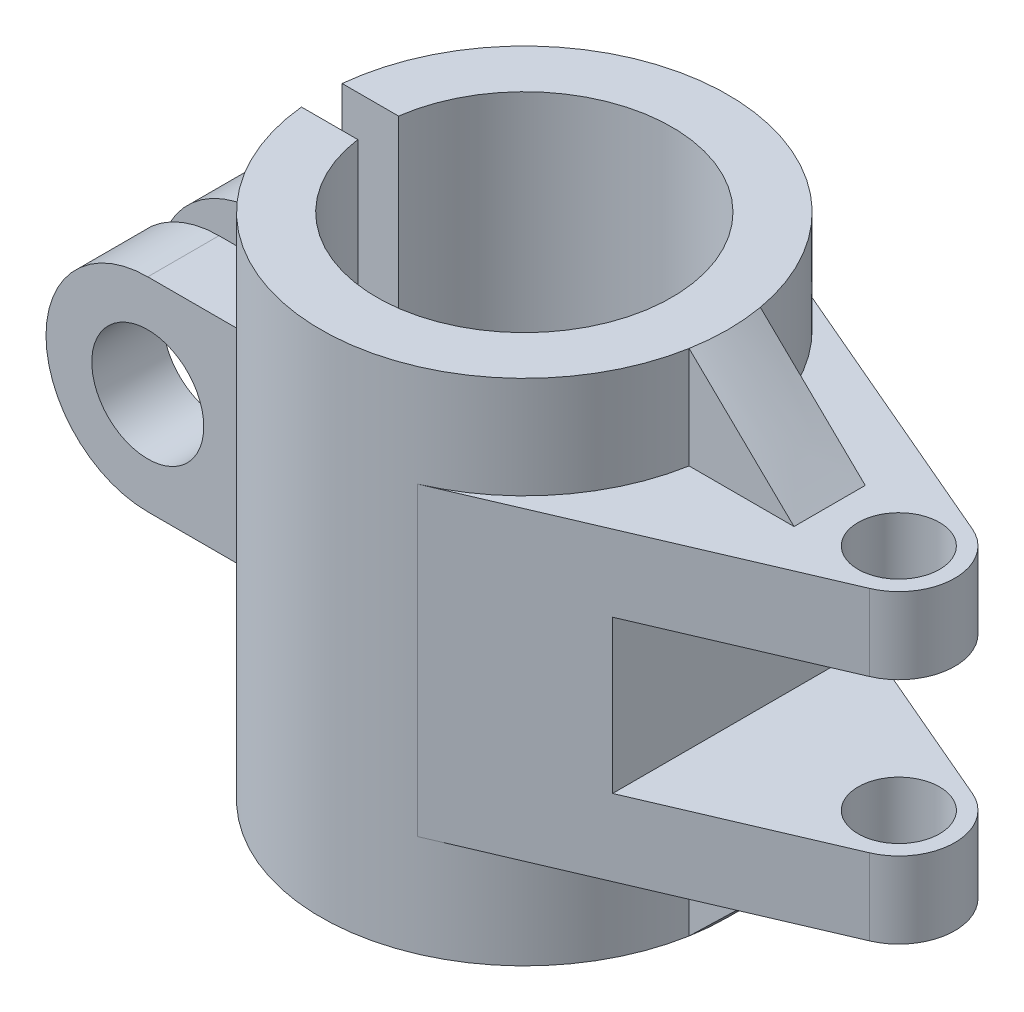
ISO-10303-21;
HEADER;
FILE_DESCRIPTION(('STEP AP214'),'2;1');
FILE_NAME('part.step','',(''),(''),'','','');
FILE_SCHEMA(('AUTOMOTIVE_DESIGN { 1 0 10303 214 1 1 1 1 }'));
ENDSEC;
DATA;
#1=APPLICATION_CONTEXT('core data for automotive mechanical design processes');
#2=APPLICATION_PROTOCOL_DEFINITION('international standard','automotive_design',2000,#1);
#3=PRODUCT_CONTEXT('',#1,'mechanical');
#4=PRODUCT('Part','Part','',(#3));
#5=PRODUCT_RELATED_PRODUCT_CATEGORY('part','',(#4));
#6=PRODUCT_DEFINITION_FORMATION('','',#4);
#7=PRODUCT_DEFINITION_CONTEXT('part definition',#1,'design');
#8=PRODUCT_DEFINITION('design','',#6,#7);
#9=PRODUCT_DEFINITION_SHAPE('','',#8);
#10=(LENGTH_UNIT() NAMED_UNIT(*) SI_UNIT(.MILLI.,.METRE.));
#11=(NAMED_UNIT(*) PLANE_ANGLE_UNIT() SI_UNIT($,.RADIAN.));
#12=(NAMED_UNIT(*) SI_UNIT($,.STERADIAN.) SOLID_ANGLE_UNIT());
#13=UNCERTAINTY_MEASURE_WITH_UNIT(LENGTH_MEASURE(1.E-05),#10,'distance_accuracy_value','');
#14=(GEOMETRIC_REPRESENTATION_CONTEXT(3) GLOBAL_UNCERTAINTY_ASSIGNED_CONTEXT((#13)) GLOBAL_UNIT_ASSIGNED_CONTEXT((#10,
#11,#12)) REPRESENTATION_CONTEXT('',''));
#15=CARTESIAN_POINT('',(0.,0.,0.));
#16=DIRECTION('',(0.,0.,1.));
#17=DIRECTION('',(1.,0.,0.));
#18=AXIS2_PLACEMENT_3D('',#15,#16,#17);
#19=CARTESIAN_POINT('',(0.,25.,0.));
#20=DIRECTION('',(0.,-1.,0.));
#21=DIRECTION('',(0.,0.,-1.));
#22=AXIS2_PLACEMENT_3D('',#19,#20,#21);
#23=CYLINDRICAL_SURFACE('',#22,20.);
#24=DIRECTION('',(0.,-1.,0.));
#25=VECTOR('',#24,1.);
#26=CARTESIAN_POINT('',(19.6913686675152,-20.,-3.5));
#27=LINE('',#26,#25);
#28=CARTESIAN_POINT('',(19.6913686675153,-15.,-3.49999999999957));
#29=VERTEX_POINT('',#28);
#30=CARTESIAN_POINT('',(19.6913686675152,-25.,-3.5));
#31=VERTEX_POINT('',#30);
#32=EDGE_CURVE('E551',#29,#31,#27,.T.);
#33=ORIENTED_EDGE('',*,*,#32,.T.);
#34=CARTESIAN_POINT('',(0.,-25.,0.));
#35=DIRECTION('',(0.,1.,0.));
#36=DIRECTION('',(0.,0.,1.));
#37=AXIS2_PLACEMENT_3D('',#34,#35,#36);
#38=CIRCLE('',#37,20.);
#39=CARTESIAN_POINT('',(-19.8997487421324,-25.,-2.));
#40=VERTEX_POINT('',#39);
#41=EDGE_CURVE('E1000',#31,#40,#38,.T.);
#42=ORIENTED_EDGE('',*,*,#41,.T.);
#43=DIRECTION('',(0.,-1.,0.));
#44=VECTOR('',#43,1.);
#45=CARTESIAN_POINT('',(-19.8997487421324,25.,-2.));
#46=LINE('',#45,#44);
#47=CARTESIAN_POINT('',(-19.8997487421324,-10.,-2.));
#48=VERTEX_POINT('',#47);
#49=EDGE_CURVE('E986',#48,#40,#46,.T.);
#50=ORIENTED_EDGE('',*,*,#49,.F.);
#51=CARTESIAN_POINT('',(0.,-10.,0.));
#52=DIRECTION('',(0.,-1.,0.));
#53=DIRECTION('',(0.,0.,-1.));
#54=AXIS2_PLACEMENT_3D('',#51,#52,#53);
#55=CIRCLE('',#54,20.);
#56=CARTESIAN_POINT('',(-17.8605710994918,-10.,-9.));
#57=VERTEX_POINT('',#56);
#58=EDGE_CURVE('E894',#48,#57,#55,.T.);
#59=ORIENTED_EDGE('',*,*,#58,.T.);
#60=DIRECTION('',(0.,-1.,0.));
#61=VECTOR('',#60,1.);
#62=CARTESIAN_POINT('',(-17.8605710994918,10.,-9.));
#63=LINE('',#62,#61);
#64=CARTESIAN_POINT('',(-17.8605710994918,10.,-9.));
#65=VERTEX_POINT('',#64);
#66=EDGE_CURVE('E905',#65,#57,#63,.T.);
#67=ORIENTED_EDGE('',*,*,#66,.F.);
#68=CARTESIAN_POINT('',(0.,10.,0.));
#69=DIRECTION('',(0.,-1.,0.));
#70=DIRECTION('',(0.,0.,-1.));
#71=AXIS2_PLACEMENT_3D('',#68,#69,#70);
#72=CIRCLE('',#71,20.);
#73=CARTESIAN_POINT('',(-19.8997487421324,10.,-2.));
#74=VERTEX_POINT('',#73);
#75=EDGE_CURVE('E911',#74,#65,#72,.T.);
#76=ORIENTED_EDGE('',*,*,#75,.F.);
#77=CARTESIAN_POINT('',(-19.8997487421324,25.,-2.));
#78=VERTEX_POINT('',#77);
#79=EDGE_CURVE('E984',#78,#74,#46,.T.);
#80=ORIENTED_EDGE('',*,*,#79,.F.);
#81=CARTESIAN_POINT('',(0.,25.,0.));
#82=DIRECTION('',(0.,1.,0.));
#83=DIRECTION('',(0.,0.,1.));
#84=AXIS2_PLACEMENT_3D('',#81,#82,#83);
#85=CIRCLE('',#84,20.);
#86=CARTESIAN_POINT('',(19.6913686675152,25.,-3.5));
#87=VERTEX_POINT('',#86);
#88=EDGE_CURVE('E1072',#87,#78,#85,.T.);
#89=ORIENTED_EDGE('',*,*,#88,.F.);
#90=DIRECTION('',(0.,1.,0.));
#91=VECTOR('',#90,1.);
#92=CARTESIAN_POINT('',(19.6913686675152,20.,-3.5));
#93=LINE('',#92,#91);
#94=CARTESIAN_POINT('',(19.6913686675152,15.,-3.49999999999999));
#95=VERTEX_POINT('',#94);
#96=EDGE_CURVE('E1108',#95,#87,#93,.T.);
#97=ORIENTED_EDGE('',*,*,#96,.F.);
#98=CARTESIAN_POINT('',(0.,15.,0.));
#99=DIRECTION('',(0.,1.,0.));
#100=DIRECTION('',(0.,0.,1.));
#101=AXIS2_PLACEMENT_3D('',#98,#99,#100);
#102=CIRCLE('',#101,20.);
#103=CARTESIAN_POINT('',(7.8804347826087,15.,-18.3820224033443));
#104=VERTEX_POINT('',#103);
#105=EDGE_CURVE('E967',#95,#104,#102,.T.);
#106=ORIENTED_EDGE('',*,*,#105,.T.);
#107=DIRECTION('',(0.,-1.,0.));
#108=VECTOR('',#107,1.);
#109=CARTESIAN_POINT('',(7.8804347826087,15.,-18.3820224033443));
#110=LINE('',#109,#108);
#111=CARTESIAN_POINT('',(7.8804347826087,-15.,-18.3820224033443));
#112=VERTEX_POINT('',#111);
#113=EDGE_CURVE('E1207',#104,#112,#110,.T.);
#114=ORIENTED_EDGE('',*,*,#113,.T.);
#115=CARTESIAN_POINT('',(0.,-15.,0.));
#116=DIRECTION('',(0.,1.,0.));
#117=DIRECTION('',(0.,0.,1.));
#118=AXIS2_PLACEMENT_3D('',#115,#116,#117);
#119=CIRCLE('',#118,20.);
#120=EDGE_CURVE('E1065',#29,#112,#119,.T.);
#121=ORIENTED_EDGE('',*,*,#120,.F.);
#122=EDGE_LOOP('',(#33,#42,#50,#59,#67,#76,#80,#89,#97,#106,#114,#121));
#123=FACE_BOUND('',#122,.T.);
#124=ADVANCED_FACE('F533',(#123),#23,.T.);
#125=CARTESIAN_POINT('',(-28.,0.,-11.));
#126=DIRECTION('',(0.,0.,1.));
#127=DIRECTION('',(1.,0.,0.));
#128=AXIS2_PLACEMENT_3D('',#125,#126,#127);
#129=CYLINDRICAL_SURFACE('',#128,10.);
#130=CARTESIAN_POINT('',(-28.,0.,2.));
#131=DIRECTION('',(0.,0.,-1.));
#132=DIRECTION('',(-1.,0.,0.));
#133=AXIS2_PLACEMENT_3D('',#130,#131,#132);
#134=CIRCLE('',#133,10.);
#135=CARTESIAN_POINT('',(-28.,-10.,2.));
#136=VERTEX_POINT('',#135);
#137=CARTESIAN_POINT('',(-28.,10.,2.));
#138=VERTEX_POINT('',#137);
#139=EDGE_CURVE('E1191',#136,#138,#134,.T.);
#140=ORIENTED_EDGE('',*,*,#139,.F.);
#141=DIRECTION('',(0.,0.,1.));
#142=VECTOR('',#141,1.);
#143=CARTESIAN_POINT('',(-28.,-10.,-11.));
#144=LINE('',#143,#142);
#145=CARTESIAN_POINT('',(-28.,-10.,9.));
#146=VERTEX_POINT('',#145);
#147=EDGE_CURVE('E889',#136,#146,#144,.T.);
#148=ORIENTED_EDGE('',*,*,#147,.T.);
#149=CARTESIAN_POINT('',(-28.,0.,9.));
#150=DIRECTION('',(0.,0.,1.));
#151=DIRECTION('',(1.,0.,0.));
#152=AXIS2_PLACEMENT_3D('',#149,#150,#151);
#153=CIRCLE('',#152,10.);
#154=CARTESIAN_POINT('',(-28.,10.,9.));
#155=VERTEX_POINT('',#154);
#156=EDGE_CURVE('E888',#155,#146,#153,.T.);
#157=ORIENTED_EDGE('',*,*,#156,.F.);
#158=DIRECTION('',(0.,0.,1.));
#159=VECTOR('',#158,1.);
#160=CARTESIAN_POINT('',(-28.,10.,-11.));
#161=LINE('',#160,#159);
#162=EDGE_CURVE('E1180',#138,#155,#161,.T.);
#163=ORIENTED_EDGE('',*,*,#162,.F.);
#164=EDGE_LOOP('',(#140,#148,#157,#163));
#165=FACE_BOUND('',#164,.T.);
#166=ADVANCED_FACE('F852',(#165),#129,.T.);
#167=CARTESIAN_POINT('',(-28.,0.,-27.0277563773199));
#168=DIRECTION('',(0.,0.,1.));
#169=DIRECTION('',(1.,0.,0.));
#170=AXIS2_PLACEMENT_3D('',#167,#168,#169);
#171=CYLINDRICAL_SURFACE('',#170,5.5);
#172=CARTESIAN_POINT('',(-28.,0.,9.));
#173=DIRECTION('',(0.,0.,1.));
#174=DIRECTION('',(1.,0.,0.));
#175=AXIS2_PLACEMENT_3D('',#172,#173,#174);
#176=CIRCLE('',#175,5.5);
#177=CARTESIAN_POINT('',(-22.5,0.,9.));
#178=VERTEX_POINT('',#177);
#179=EDGE_CURVE('E1499',#178,#178,#176,.T.);
#180=ORIENTED_EDGE('',*,*,#179,.T.);
#181=EDGE_LOOP('',(#180));
#182=FACE_BOUND('',#181,.T.);
#183=CARTESIAN_POINT('',(-28.,0.,2.00000000000001));
#184=DIRECTION('',(0.,0.,-1.));
#185=DIRECTION('',(-1.,0.,0.));
#186=AXIS2_PLACEMENT_3D('',#183,#184,#185);
#187=CIRCLE('',#186,5.5);
#188=CARTESIAN_POINT('',(-33.5,0.,2.00000000000001));
#189=VERTEX_POINT('',#188);
#190=EDGE_CURVE('E1502',#189,#189,#187,.T.);
#191=ORIENTED_EDGE('',*,*,#190,.T.);
#192=EDGE_LOOP('',(#191));
#193=FACE_BOUND('',#192,.T.);
#194=ADVANCED_FACE('F847',(#182,#193),#171,.F.);
#195=CARTESIAN_POINT('',(0.,25.,2.));
#196=DIRECTION('',(0.,0.,-1.));
#197=DIRECTION('',(-1.,0.,0.));
#198=AXIS2_PLACEMENT_3D('',#195,#196,#197);
#199=PLANE('',#198);
#200=ORIENTED_EDGE('',*,*,#190,.F.);
#201=EDGE_LOOP('',(#200));
#202=FACE_BOUND('',#201,.T.);
#203=DIRECTION('',(-1.,0.,0.));
#204=VECTOR('',#203,1.);
#205=CARTESIAN_POINT('',(0.,10.,2.));
#206=LINE('',#205,#204);
#207=CARTESIAN_POINT('',(-19.8997487421324,10.,2.));
#208=VERTEX_POINT('',#207);
#209=EDGE_CURVE('E915',#208,#138,#206,.T.);
#210=ORIENTED_EDGE('',*,*,#209,.F.);
#211=DIRECTION('',(0.,-1.,0.));
#212=VECTOR('',#211,1.);
#213=CARTESIAN_POINT('',(-19.8997487421324,25.,2.));
#214=LINE('',#213,#212);
#215=CARTESIAN_POINT('',(-19.8997487421324,25.,2.));
#216=VERTEX_POINT('',#215);
#217=EDGE_CURVE('E981',#216,#208,#214,.T.);
#218=ORIENTED_EDGE('',*,*,#217,.F.);
#219=DIRECTION('',(1.,0.,0.));
#220=VECTOR('',#219,1.);
#221=CARTESIAN_POINT('',(0.,25.,2.));
#222=LINE('',#221,#220);
#223=CARTESIAN_POINT('',(-14.3614066163451,25.,2.));
#224=VERTEX_POINT('',#223);
#225=EDGE_CURVE('E1069',#216,#224,#222,.T.);
#226=ORIENTED_EDGE('',*,*,#225,.T.);
#227=DIRECTION('',(0.,-1.,0.));
#228=VECTOR('',#227,1.);
#229=CARTESIAN_POINT('',(-14.3614066163451,25.,2.));
#230=LINE('',#229,#228);
#231=CARTESIAN_POINT('',(-14.3614066163451,-25.,2.));
#232=VERTEX_POINT('',#231);
#233=EDGE_CURVE('E979',#224,#232,#230,.T.);
#234=ORIENTED_EDGE('',*,*,#233,.T.);
#235=DIRECTION('',(1.,0.,0.));
#236=VECTOR('',#235,1.);
#237=CARTESIAN_POINT('',(0.,-25.,2.));
#238=LINE('',#237,#236);
#239=CARTESIAN_POINT('',(-19.8997487421324,-25.,2.));
#240=VERTEX_POINT('',#239);
#241=EDGE_CURVE('E997',#240,#232,#238,.T.);
#242=ORIENTED_EDGE('',*,*,#241,.F.);
#243=CARTESIAN_POINT('',(-19.8997487421324,-10.,2.));
#244=VERTEX_POINT('',#243);
#245=EDGE_CURVE('E983',#244,#240,#214,.T.);
#246=ORIENTED_EDGE('',*,*,#245,.F.);
#247=DIRECTION('',(-1.,0.,0.));
#248=VECTOR('',#247,1.);
#249=CARTESIAN_POINT('',(0.,-10.,2.));
#250=LINE('',#249,#248);
#251=EDGE_CURVE('E914',#244,#136,#250,.T.);
#252=ORIENTED_EDGE('',*,*,#251,.T.);
#253=ORIENTED_EDGE('',*,*,#139,.T.);
#254=EDGE_LOOP('',(#210,#218,#226,#234,#242,#246,#252,#253));
#255=FACE_BOUND('',#254,.T.);
#256=ADVANCED_FACE('F839',(#202,#255),#199,.T.);
#257=CARTESIAN_POINT('',(0.,25.,-2.));
#258=DIRECTION('',(0.,0.,-1.));
#259=DIRECTION('',(-1.,0.,0.));
#260=AXIS2_PLACEMENT_3D('',#257,#258,#259);
#261=PLANE('',#260);
#262=CARTESIAN_POINT('',(-28.,0.,-2.));
#263=DIRECTION('',(0.,0.,-1.));
#264=DIRECTION('',(-1.,0.,0.));
#265=AXIS2_PLACEMENT_3D('',#262,#263,#264);
#266=CIRCLE('',#265,5.5);
#267=CARTESIAN_POINT('',(-33.5,0.,-2.));
#268=VERTEX_POINT('',#267);
#269=EDGE_CURVE('E1100',#268,#268,#266,.T.);
#270=ORIENTED_EDGE('',*,*,#269,.T.);
#271=EDGE_LOOP('',(#270));
#272=FACE_BOUND('',#271,.T.);
#273=DIRECTION('',(-1.,0.,0.));
#274=VECTOR('',#273,1.);
#275=CARTESIAN_POINT('',(-19.8997487421324,-10.,-2.));
#276=LINE('',#275,#274);
#277=CARTESIAN_POINT('',(-28.,-10.,-2.));
#278=VERTEX_POINT('',#277);
#279=EDGE_CURVE('E892',#48,#278,#276,.T.);
#280=ORIENTED_EDGE('',*,*,#279,.F.);
#281=ORIENTED_EDGE('',*,*,#49,.T.);
#282=DIRECTION('',(1.,0.,0.));
#283=VECTOR('',#282,1.);
#284=CARTESIAN_POINT('',(0.,-25.,-2.));
#285=LINE('',#284,#283);
#286=CARTESIAN_POINT('',(-14.3614066163451,-25.,-2.));
#287=VERTEX_POINT('',#286);
#288=EDGE_CURVE('E990',#40,#287,#285,.T.);
#289=ORIENTED_EDGE('',*,*,#288,.T.);
#290=DIRECTION('',(0.,-1.,0.));
#291=VECTOR('',#290,1.);
#292=CARTESIAN_POINT('',(-14.3614066163451,25.,-2.));
#293=LINE('',#292,#291);
#294=CARTESIAN_POINT('',(-14.3614066163451,25.,-2.));
#295=VERTEX_POINT('',#294);
#296=EDGE_CURVE('E987',#295,#287,#293,.T.);
#297=ORIENTED_EDGE('',*,*,#296,.F.);
#298=DIRECTION('',(1.,0.,0.));
#299=VECTOR('',#298,1.);
#300=CARTESIAN_POINT('',(0.,25.,-2.));
#301=LINE('',#300,#299);
#302=EDGE_CURVE('E989',#78,#295,#301,.T.);
#303=ORIENTED_EDGE('',*,*,#302,.F.);
#304=ORIENTED_EDGE('',*,*,#79,.T.);
#305=DIRECTION('',(-1.,0.,0.));
#306=VECTOR('',#305,1.);
#307=CARTESIAN_POINT('',(-19.8997487421324,10.,-2.));
#308=LINE('',#307,#306);
#309=CARTESIAN_POINT('',(-28.,10.,-2.));
#310=VERTEX_POINT('',#309);
#311=EDGE_CURVE('E902',#74,#310,#308,.T.);
#312=ORIENTED_EDGE('',*,*,#311,.T.);
#313=CARTESIAN_POINT('',(-28.,0.,-2.));
#314=DIRECTION('',(0.,0.,-1.));
#315=DIRECTION('',(-1.,0.,0.));
#316=AXIS2_PLACEMENT_3D('',#313,#314,#315);
#317=CIRCLE('',#316,10.);
#318=EDGE_CURVE('E885',#278,#310,#317,.T.);
#319=ORIENTED_EDGE('',*,*,#318,.F.);
#320=EDGE_LOOP('',(#280,#281,#289,#297,#303,#304,#312,#319));
#321=FACE_BOUND('',#320,.T.);
#322=ADVANCED_FACE('F835',(#272,#321),#261,.F.);
#323=CARTESIAN_POINT('',(0.,10.,0.));
#324=DIRECTION('',(0.,1.,0.));
#325=DIRECTION('',(0.,0.,1.));
#326=AXIS2_PLACEMENT_3D('',#323,#324,#325);
#327=PLANE('',#326);
#328=ORIENTED_EDGE('',*,*,#209,.T.);
#329=ORIENTED_EDGE('',*,*,#162,.T.);
#330=DIRECTION('',(1.,0.,0.));
#331=VECTOR('',#330,1.);
#332=CARTESIAN_POINT('',(0.,10.,9.));
#333=LINE('',#332,#331);
#334=CARTESIAN_POINT('',(-17.8605710994918,10.,9.));
#335=VERTEX_POINT('',#334);
#336=EDGE_CURVE('E918',#155,#335,#333,.T.);
#337=ORIENTED_EDGE('',*,*,#336,.T.);
#338=CARTESIAN_POINT('',(0.,10.,0.));
#339=DIRECTION('',(0.,1.,0.));
#340=DIRECTION('',(0.,0.,1.));
#341=AXIS2_PLACEMENT_3D('',#338,#339,#340);
#342=CIRCLE('',#341,20.);
#343=EDGE_CURVE('E930',#208,#335,#342,.T.);
#344=ORIENTED_EDGE('',*,*,#343,.F.);
#345=EDGE_LOOP('',(#328,#329,#337,#344));
#346=FACE_BOUND('',#345,.T.);
#347=ADVANCED_FACE('F838',(#346),#327,.T.);
#348=CARTESIAN_POINT('',(0.,-10.,0.));
#349=DIRECTION('',(0.,1.,0.));
#350=DIRECTION('',(0.,0.,1.));
#351=AXIS2_PLACEMENT_3D('',#348,#349,#350);
#352=PLANE('',#351);
#353=ORIENTED_EDGE('',*,*,#147,.F.);
#354=ORIENTED_EDGE('',*,*,#251,.F.);
#355=CARTESIAN_POINT('',(0.,-10.,0.));
#356=DIRECTION('',(0.,1.,0.));
#357=DIRECTION('',(0.,0.,1.));
#358=AXIS2_PLACEMENT_3D('',#355,#356,#357);
#359=CIRCLE('',#358,20.);
#360=CARTESIAN_POINT('',(-17.8605710994918,-10.,9.));
#361=VERTEX_POINT('',#360);
#362=EDGE_CURVE('E927',#244,#361,#359,.T.);
#363=ORIENTED_EDGE('',*,*,#362,.T.);
#364=DIRECTION('',(1.,0.,0.));
#365=VECTOR('',#364,1.);
#366=CARTESIAN_POINT('',(0.,-10.,9.));
#367=LINE('',#366,#365);
#368=EDGE_CURVE('E919',#146,#361,#367,.T.);
#369=ORIENTED_EDGE('',*,*,#368,.F.);
#370=EDGE_LOOP('',(#353,#354,#363,#369));
#371=FACE_BOUND('',#370,.T.);
#372=ADVANCED_FACE('F1190',(#371),#352,.F.);
#373=CARTESIAN_POINT('',(0.,10.,9.));
#374=DIRECTION('',(0.,0.,-1.));
#375=DIRECTION('',(-1.,0.,0.));
#376=AXIS2_PLACEMENT_3D('',#373,#374,#375);
#377=PLANE('',#376);
#378=ORIENTED_EDGE('',*,*,#156,.T.);
#379=ORIENTED_EDGE('',*,*,#368,.T.);
#380=DIRECTION('',(0.,-1.,0.));
#381=VECTOR('',#380,1.);
#382=CARTESIAN_POINT('',(-17.8605710994918,10.,9.));
#383=LINE('',#382,#381);
#384=EDGE_CURVE('E921',#335,#361,#383,.T.);
#385=ORIENTED_EDGE('',*,*,#384,.F.);
#386=ORIENTED_EDGE('',*,*,#336,.F.);
#387=EDGE_LOOP('',(#378,#379,#385,#386));
#388=FACE_BOUND('',#387,.T.);
#389=ORIENTED_EDGE('',*,*,#179,.F.);
#390=EDGE_LOOP('',(#389));
#391=FACE_BOUND('',#390,.T.);
#392=ADVANCED_FACE('F1182',(#388,#391),#377,.F.);
#393=CARTESIAN_POINT('',(-33.,10.,-9.));
#394=DIRECTION('',(0.,0.,-1.));
#395=DIRECTION('',(-1.,0.,0.));
#396=AXIS2_PLACEMENT_3D('',#393,#394,#395);
#397=PLANE('',#396);
#398=CARTESIAN_POINT('',(-28.,0.,-9.));
#399=DIRECTION('',(0.,0.,-1.));
#400=DIRECTION('',(-1.,0.,0.));
#401=AXIS2_PLACEMENT_3D('',#398,#399,#400);
#402=CIRCLE('',#401,5.5);
#403=CARTESIAN_POINT('',(-33.5,0.,-9.));
#404=VERTEX_POINT('',#403);
#405=EDGE_CURVE('E1494',#404,#404,#402,.F.);
#406=ORIENTED_EDGE('',*,*,#405,.T.);
#407=EDGE_LOOP('',(#406));
#408=FACE_BOUND('',#407,.T.);
#409=CARTESIAN_POINT('',(-28.,0.,-9.));
#410=DIRECTION('',(0.,0.,-1.));
#411=DIRECTION('',(-1.,0.,0.));
#412=AXIS2_PLACEMENT_3D('',#409,#410,#411);
#413=CIRCLE('',#412,10.);
#414=CARTESIAN_POINT('',(-28.,-10.,-9.));
#415=VERTEX_POINT('',#414);
#416=CARTESIAN_POINT('',(-28.,10.,-9.));
#417=VERTEX_POINT('',#416);
#418=EDGE_CURVE('E13',#415,#417,#413,.T.);
#419=ORIENTED_EDGE('',*,*,#418,.T.);
#420=DIRECTION('',(1.,0.,0.));
#421=VECTOR('',#420,1.);
#422=CARTESIAN_POINT('',(-33.,10.,-9.));
#423=LINE('',#422,#421);
#424=EDGE_CURVE('E899',#417,#65,#423,.T.);
#425=ORIENTED_EDGE('',*,*,#424,.T.);
#426=ORIENTED_EDGE('',*,*,#66,.T.);
#427=DIRECTION('',(1.,0.,0.));
#428=VECTOR('',#427,1.);
#429=CARTESIAN_POINT('',(-33.,-10.,-9.));
#430=LINE('',#429,#428);
#431=EDGE_CURVE('E898',#415,#57,#430,.T.);
#432=ORIENTED_EDGE('',*,*,#431,.F.);
#433=EDGE_LOOP('',(#419,#425,#426,#432));
#434=FACE_BOUND('',#433,.T.);
#435=ADVANCED_FACE('F844',(#408,#434),#397,.T.);
#436=CARTESIAN_POINT('',(19.6913686675152,-25.,3.5));
#437=VERTEX_POINT('',#436);
#438=EDGE_CURVE('E994',#240,#437,#38,.T.);
#439=ORIENTED_EDGE('',*,*,#438,.T.);
#440=DIRECTION('',(0.,-1.,0.));
#441=VECTOR('',#440,1.);
#442=CARTESIAN_POINT('',(19.6913686675152,-20.,3.5));
#443=LINE('',#442,#441);
#444=CARTESIAN_POINT('',(19.6913686675154,-15.,3.4999999999987));
#445=VERTEX_POINT('',#444);
#446=EDGE_CURVE('E798',#445,#437,#443,.T.);
#447=ORIENTED_EDGE('',*,*,#446,.F.);
#448=CARTESIAN_POINT('',(7.8804347826087,-15.,18.3820224033443));
#449=VERTEX_POINT('',#448);
#450=EDGE_CURVE('E1216',#449,#445,#119,.T.);
#451=ORIENTED_EDGE('',*,*,#450,.F.);
#452=DIRECTION('',(0.,-1.,0.));
#453=VECTOR('',#452,1.);
#454=CARTESIAN_POINT('',(7.8804347826087,15.,18.3820224033443));
#455=LINE('',#454,#453);
#456=CARTESIAN_POINT('',(7.8804347826087,15.,18.3820224033443));
#457=VERTEX_POINT('',#456);
#458=EDGE_CURVE('E1061',#457,#449,#455,.T.);
#459=ORIENTED_EDGE('',*,*,#458,.F.);
#460=CARTESIAN_POINT('',(19.6913686675152,15.,3.5));
#461=VERTEX_POINT('',#460);
#462=EDGE_CURVE('E970',#457,#461,#102,.T.);
#463=ORIENTED_EDGE('',*,*,#462,.T.);
#464=DIRECTION('',(0.,1.,0.));
#465=VECTOR('',#464,1.);
#466=CARTESIAN_POINT('',(19.6913686675152,20.,3.5));
#467=LINE('',#466,#465);
#468=CARTESIAN_POINT('',(19.6913686675152,25.,3.5));
#469=VERTEX_POINT('',#468);
#470=EDGE_CURVE('E1102',#461,#469,#467,.T.);
#471=ORIENTED_EDGE('',*,*,#470,.T.);
#472=EDGE_CURVE('E1079',#216,#469,#85,.T.);
#473=ORIENTED_EDGE('',*,*,#472,.F.);
#474=ORIENTED_EDGE('',*,*,#217,.T.);
#475=ORIENTED_EDGE('',*,*,#343,.T.);
#476=ORIENTED_EDGE('',*,*,#384,.T.);
#477=ORIENTED_EDGE('',*,*,#362,.F.);
#478=ORIENTED_EDGE('',*,*,#245,.T.);
#479=EDGE_LOOP('',(#439,#447,#451,#459,#463,#471,#473,#474,#475,#476,#477,#478));
#480=FACE_BOUND('',#479,.T.);
#481=ADVANCED_FACE('F841',(#480),#23,.T.);
#482=CARTESIAN_POINT('',(36.8,15.,0.));
#483=DIRECTION('',(0.,-1.,0.));
#484=DIRECTION('',(0.,0.,-1.));
#485=AXIS2_PLACEMENT_3D('',#482,#483,#484);
#486=CYLINDRICAL_SURFACE('',#485,4.00000000000001);
#487=CARTESIAN_POINT('',(36.8,-7.5,0.));
#488=DIRECTION('',(0.,-1.,0.));
#489=DIRECTION('',(0.,0.,-1.));
#490=AXIS2_PLACEMENT_3D('',#487,#488,#489);
#491=CIRCLE('',#490,4.00000000000001);
#492=CARTESIAN_POINT('',(36.8,-7.5,-4.00000000000001));
#493=VERTEX_POINT('',#492);
#494=EDGE_CURVE('E954',#493,#493,#491,.T.);
#495=ORIENTED_EDGE('',*,*,#494,.F.);
#496=EDGE_LOOP('',(#495));
#497=FACE_BOUND('',#496,.T.);
#498=CARTESIAN_POINT('',(36.8,-15.,0.));
#499=DIRECTION('',(0.,1.,0.));
#500=DIRECTION('',(0.,0.,1.));
#501=AXIS2_PLACEMENT_3D('',#498,#499,#500);
#502=CIRCLE('',#501,4.00000000000001);
#503=CARTESIAN_POINT('',(36.8,-15.,4.00000000000001));
#504=VERTEX_POINT('',#503);
#505=EDGE_CURVE('E960',#504,#504,#502,.T.);
#506=ORIENTED_EDGE('',*,*,#505,.F.);
#507=EDGE_LOOP('',(#506));
#508=FACE_BOUND('',#507,.T.);
#509=ADVANCED_FACE('F843',(#497,#508),#486,.F.);
#510=CARTESIAN_POINT('',(36.8,15.,0.));
#511=DIRECTION('',(0.,-1.,0.));
#512=DIRECTION('',(0.,0.,-1.));
#513=AXIS2_PLACEMENT_3D('',#510,#511,#512);
#514=CYLINDRICAL_SURFACE('',#513,5.5);
#515=CARTESIAN_POINT('',(36.8,-7.5,0.));
#516=DIRECTION('',(0.,-1.,0.));
#517=DIRECTION('',(0.,0.,-1.));
#518=AXIS2_PLACEMENT_3D('',#515,#516,#517);
#519=CIRCLE('',#518,5.5);
#520=CARTESIAN_POINT('',(38.9671195652174,-7.5,-5.05505616091967));
#521=VERTEX_POINT('',#520);
#522=CARTESIAN_POINT('',(38.9671195652174,-7.5,5.05505616091968));
#523=VERTEX_POINT('',#522);
#524=EDGE_CURVE('E975',#521,#523,#519,.T.);
#525=ORIENTED_EDGE('',*,*,#524,.T.);
#526=DIRECTION('',(0.,-1.,0.));
#527=VECTOR('',#526,1.);
#528=CARTESIAN_POINT('',(38.9671195652174,15.,5.05505616091968));
#529=LINE('',#528,#527);
#530=CARTESIAN_POINT('',(38.9671195652174,-15.,5.05505616091968));
#531=VERTEX_POINT('',#530);
#532=EDGE_CURVE('E1200',#523,#531,#529,.T.);
#533=ORIENTED_EDGE('',*,*,#532,.T.);
#534=CARTESIAN_POINT('',(36.8,-15.,0.));
#535=DIRECTION('',(0.,1.,0.));
#536=DIRECTION('',(0.,0.,1.));
#537=AXIS2_PLACEMENT_3D('',#534,#535,#536);
#538=CIRCLE('',#537,5.5);
#539=CARTESIAN_POINT('',(38.9671195652174,-15.,-5.05505616091968));
#540=VERTEX_POINT('',#539);
#541=EDGE_CURVE('E1053',#531,#540,#538,.T.);
#542=ORIENTED_EDGE('',*,*,#541,.T.);
#543=DIRECTION('',(0.,-1.,0.));
#544=VECTOR('',#543,1.);
#545=CARTESIAN_POINT('',(38.9671195652174,15.,-5.05505616091968));
#546=LINE('',#545,#544);
#547=EDGE_CURVE('E1206',#521,#540,#546,.T.);
#548=ORIENTED_EDGE('',*,*,#547,.F.);
#549=EDGE_LOOP('',(#525,#533,#542,#548));
#550=FACE_BOUND('',#549,.T.);
#551=ADVANCED_FACE('F1031',(#550),#514,.T.);
#552=CARTESIAN_POINT('',(0.,25.,0.));
#553=DIRECTION('',(0.,-1.,0.));
#554=DIRECTION('',(0.,0.,-1.));
#555=AXIS2_PLACEMENT_3D('',#552,#553,#554);
#556=CYLINDRICAL_SURFACE('',#555,14.5);
#557=CARTESIAN_POINT('',(0.,-25.,0.));
#558=DIRECTION('',(0.,1.,0.));
#559=DIRECTION('',(0.,0.,1.));
#560=AXIS2_PLACEMENT_3D('',#557,#558,#559);
#561=CIRCLE('',#560,14.5);
#562=EDGE_CURVE('E1195',#232,#287,#561,.T.);
#563=ORIENTED_EDGE('',*,*,#562,.F.);
#564=ORIENTED_EDGE('',*,*,#233,.F.);
#565=CARTESIAN_POINT('',(0.,25.,0.));
#566=DIRECTION('',(0.,1.,0.));
#567=DIRECTION('',(0.,0.,1.));
#568=AXIS2_PLACEMENT_3D('',#565,#566,#567);
#569=CIRCLE('',#568,14.5);
#570=EDGE_CURVE('E993',#224,#295,#569,.T.);
#571=ORIENTED_EDGE('',*,*,#570,.T.);
#572=ORIENTED_EDGE('',*,*,#296,.T.);
#573=EDGE_LOOP('',(#563,#564,#571,#572));
#574=FACE_BOUND('',#573,.T.);
#575=ADVANCED_FACE('F535',(#574),#556,.F.);
#576=CARTESIAN_POINT('',(0.,25.,0.));
#577=DIRECTION('',(0.,1.,0.));
#578=DIRECTION('',(0.,0.,1.));
#579=AXIS2_PLACEMENT_3D('',#576,#577,#578);
#580=PLANE('',#579);
#581=ORIENTED_EDGE('',*,*,#570,.F.);
#582=ORIENTED_EDGE('',*,*,#225,.F.);
#583=ORIENTED_EDGE('',*,*,#472,.T.);
#584=CARTESIAN_POINT('',(0.,25.,0.));
#585=DIRECTION('',(0.,1.,0.));
#586=DIRECTION('',(0.,0.,1.));
#587=AXIS2_PLACEMENT_3D('',#584,#585,#586);
#588=CIRCLE('',#587,20.);
#589=EDGE_CURVE('E1160',#469,#87,#588,.T.);
#590=ORIENTED_EDGE('',*,*,#589,.T.);
#591=ORIENTED_EDGE('',*,*,#88,.T.);
#592=ORIENTED_EDGE('',*,*,#302,.T.);
#593=EDGE_LOOP('',(#581,#582,#583,#590,#591,#592));
#594=FACE_BOUND('',#593,.T.);
#595=ADVANCED_FACE('F832',(#594),#580,.T.);
#596=CARTESIAN_POINT('',(0.,-25.,0.));
#597=DIRECTION('',(0.,1.,0.));
#598=DIRECTION('',(0.,0.,1.));
#599=AXIS2_PLACEMENT_3D('',#596,#597,#598);
#600=PLANE('',#599);
#601=ORIENTED_EDGE('',*,*,#562,.T.);
#602=ORIENTED_EDGE('',*,*,#288,.F.);
#603=ORIENTED_EDGE('',*,*,#41,.F.);
#604=CARTESIAN_POINT('',(0.,-25.,0.));
#605=DIRECTION('',(0.,1.,0.));
#606=DIRECTION('',(0.,0.,1.));
#607=AXIS2_PLACEMENT_3D('',#604,#605,#606);
#608=CIRCLE('',#607,20.);
#609=EDGE_CURVE('E558',#437,#31,#608,.T.);
#610=ORIENTED_EDGE('',*,*,#609,.F.);
#611=ORIENTED_EDGE('',*,*,#438,.F.);
#612=ORIENTED_EDGE('',*,*,#241,.T.);
#613=EDGE_LOOP('',(#601,#602,#603,#610,#611,#612));
#614=FACE_BOUND('',#613,.T.);
#615=ADVANCED_FACE('F821',(#614),#600,.F.);
#616=CARTESIAN_POINT('',(7.8804347826087,15.,18.3820224033443));
#617=DIRECTION('',(-0.394021739130435,0.,-0.919101120167214));
#618=DIRECTION('',(-0.919101120167214,0.,0.394021739130435));
#619=AXIS2_PLACEMENT_3D('',#616,#617,#618);
#620=PLANE('',#619);
#621=ORIENTED_EDGE('',*,*,#532,.F.);
#622=DIRECTION('',(-0.919101120167214,0.,0.394021739130435));
#623=VECTOR('',#622,1.);
#624=CARTESIAN_POINT('',(7.8804347826087,-7.5,18.3820224033443));
#625=LINE('',#624,#623);
#626=CARTESIAN_POINT('',(21.3,-7.5,12.6290096941781));
#627=VERTEX_POINT('',#626);
#628=EDGE_CURVE('E951',#523,#627,#625,.T.);
#629=ORIENTED_EDGE('',*,*,#628,.T.);
#630=DIRECTION('',(0.,1.,0.));
#631=VECTOR('',#630,1.);
#632=CARTESIAN_POINT('',(21.3,15.,12.6290096941781));
#633=LINE('',#632,#631);
#634=CARTESIAN_POINT('',(21.3,7.5,12.6290096941781));
#635=VERTEX_POINT('',#634);
#636=EDGE_CURVE('E957',#627,#635,#633,.T.);
#637=ORIENTED_EDGE('',*,*,#636,.T.);
#638=DIRECTION('',(0.919101120167214,0.,-0.394021739130435));
#639=VECTOR('',#638,1.);
#640=CARTESIAN_POINT('',(7.8804347826087,7.5,18.3820224033443));
#641=LINE('',#640,#639);
#642=CARTESIAN_POINT('',(38.9671195652174,7.5,5.05505616091968));
#643=VERTEX_POINT('',#642);
#644=EDGE_CURVE('E942',#635,#643,#641,.T.);
#645=ORIENTED_EDGE('',*,*,#644,.T.);
#646=CARTESIAN_POINT('',(38.9671195652174,15.,5.05505616091968));
#647=VERTEX_POINT('',#646);
#648=EDGE_CURVE('E1196',#647,#643,#529,.T.);
#649=ORIENTED_EDGE('',*,*,#648,.F.);
#650=DIRECTION('',(0.919101120167214,0.,-0.394021739130435));
#651=VECTOR('',#650,1.);
#652=CARTESIAN_POINT('',(7.8804347826087,15.,18.3820224033443));
#653=LINE('',#652,#651);
#654=EDGE_CURVE('E963',#457,#647,#653,.T.);
#655=ORIENTED_EDGE('',*,*,#654,.F.);
#656=ORIENTED_EDGE('',*,*,#458,.T.);
#657=DIRECTION('',(0.919101120167214,0.,-0.394021739130435));
#658=VECTOR('',#657,1.);
#659=CARTESIAN_POINT('',(7.8804347826087,-15.,18.3820224033443));
#660=LINE('',#659,#658);
#661=EDGE_CURVE('E1214',#449,#531,#660,.T.);
#662=ORIENTED_EDGE('',*,*,#661,.T.);
#663=EDGE_LOOP('',(#621,#629,#637,#645,#649,#655,#656,#662));
#664=FACE_BOUND('',#663,.T.);
#665=ADVANCED_FACE('F831',(#664),#620,.F.);
#666=CARTESIAN_POINT('',(7.8804347826087,15.,-18.3820224033443));
#667=DIRECTION('',(-0.394021739130435,0.,0.919101120167214));
#668=DIRECTION('',(0.919101120167214,0.,0.394021739130435));
#669=AXIS2_PLACEMENT_3D('',#666,#667,#668);
#670=PLANE('',#669);
#671=DIRECTION('',(0.,-1.,0.));
#672=VECTOR('',#671,1.);
#673=CARTESIAN_POINT('',(21.3,15.,-12.6290096941781));
#674=LINE('',#673,#672);
#675=CARTESIAN_POINT('',(21.3,7.5,-12.6290096941781));
#676=VERTEX_POINT('',#675);
#677=CARTESIAN_POINT('',(21.3,-7.5,-12.6290096941781));
#678=VERTEX_POINT('',#677);
#679=EDGE_CURVE('E543',#676,#678,#674,.T.);
#680=ORIENTED_EDGE('',*,*,#679,.T.);
#681=DIRECTION('',(0.919101120167214,0.,0.394021739130435));
#682=VECTOR('',#681,1.);
#683=CARTESIAN_POINT('',(7.8804347826087,-7.5,-18.3820224033443));
#684=LINE('',#683,#682);
#685=EDGE_CURVE('E948',#678,#521,#684,.T.);
#686=ORIENTED_EDGE('',*,*,#685,.T.);
#687=ORIENTED_EDGE('',*,*,#547,.T.);
#688=DIRECTION('',(-0.919101120167214,0.,-0.394021739130435));
#689=VECTOR('',#688,1.);
#690=CARTESIAN_POINT('',(7.8804347826087,-15.,-18.3820224033443));
#691=LINE('',#690,#689);
#692=EDGE_CURVE('E1211',#540,#112,#691,.T.);
#693=ORIENTED_EDGE('',*,*,#692,.T.);
#694=ORIENTED_EDGE('',*,*,#113,.F.);
#695=DIRECTION('',(-0.919101120167214,0.,-0.394021739130435));
#696=VECTOR('',#695,1.);
#697=CARTESIAN_POINT('',(7.8804347826087,15.,-18.3820224033443));
#698=LINE('',#697,#696);
#699=CARTESIAN_POINT('',(38.9671195652174,15.,-5.05505616091968));
#700=VERTEX_POINT('',#699);
#701=EDGE_CURVE('E1210',#700,#104,#698,.T.);
#702=ORIENTED_EDGE('',*,*,#701,.F.);
#703=CARTESIAN_POINT('',(38.9671195652174,7.5,-5.05505616091967));
#704=VERTEX_POINT('',#703);
#705=EDGE_CURVE('E1202',#700,#704,#546,.T.);
#706=ORIENTED_EDGE('',*,*,#705,.T.);
#707=DIRECTION('',(-0.919101120167214,0.,-0.394021739130435));
#708=VECTOR('',#707,1.);
#709=CARTESIAN_POINT('',(7.8804347826087,7.5,-18.3820224033443));
#710=LINE('',#709,#708);
#711=EDGE_CURVE('E937',#704,#676,#710,.T.);
#712=ORIENTED_EDGE('',*,*,#711,.T.);
#713=EDGE_LOOP('',(#680,#686,#687,#693,#694,#702,#706,#712));
#714=FACE_BOUND('',#713,.T.);
#715=ADVANCED_FACE('F1015',(#714),#670,.F.);
#716=CARTESIAN_POINT('',(0.,-15.,0.));
#717=DIRECTION('',(0.,1.,0.));
#718=DIRECTION('',(0.,0.,1.));
#719=AXIS2_PLACEMENT_3D('',#716,#717,#718);
#720=PLANE('',#719);
#721=ORIENTED_EDGE('',*,*,#450,.T.);
#722=DIRECTION('',(-1.,0.,0.));
#723=VECTOR('',#722,1.);
#724=CARTESIAN_POINT('',(24.8456843337577,-15.,3.5));
#725=LINE('',#724,#723);
#726=CARTESIAN_POINT('',(30.0000000000001,-15.,3.5));
#727=VERTEX_POINT('',#726);
#728=EDGE_CURVE('E718',#727,#445,#725,.T.);
#729=ORIENTED_EDGE('',*,*,#728,.F.);
#730=DIRECTION('',(0.,0.,-1.));
#731=VECTOR('',#730,1.);
#732=CARTESIAN_POINT('',(30.0000000000001,-15.,0.));
#733=LINE('',#732,#731);
#734=CARTESIAN_POINT('',(30.0000000000001,-15.,-3.5));
#735=VERTEX_POINT('',#734);
#736=EDGE_CURVE('E710',#727,#735,#733,.T.);
#737=ORIENTED_EDGE('',*,*,#736,.T.);
#738=DIRECTION('',(-1.,0.,0.));
#739=VECTOR('',#738,1.);
#740=CARTESIAN_POINT('',(24.8456843337577,-15.,-3.5));
#741=LINE('',#740,#739);
#742=EDGE_CURVE('E716',#735,#29,#741,.T.);
#743=ORIENTED_EDGE('',*,*,#742,.T.);
#744=ORIENTED_EDGE('',*,*,#120,.T.);
#745=ORIENTED_EDGE('',*,*,#692,.F.);
#746=ORIENTED_EDGE('',*,*,#541,.F.);
#747=ORIENTED_EDGE('',*,*,#661,.F.);
#748=EDGE_LOOP('',(#721,#729,#737,#743,#744,#745,#746,#747));
#749=FACE_BOUND('',#748,.T.);
#750=ORIENTED_EDGE('',*,*,#505,.T.);
#751=EDGE_LOOP('',(#750));
#752=FACE_BOUND('',#751,.T.);
#753=ADVANCED_FACE('F714',(#749,#752),#720,.F.);
#754=CARTESIAN_POINT('',(0.,15.,0.));
#755=DIRECTION('',(0.,1.,0.));
#756=DIRECTION('',(0.,0.,1.));
#757=AXIS2_PLACEMENT_3D('',#754,#755,#756);
#758=PLANE('',#757);
#759=DIRECTION('',(-1.,0.,0.));
#760=VECTOR('',#759,1.);
#761=CARTESIAN_POINT('',(24.8456843337577,15.,3.5));
#762=LINE('',#761,#760);
#763=CARTESIAN_POINT('',(30.0000000000001,15.,3.5));
#764=VERTEX_POINT('',#763);
#765=EDGE_CURVE('E1048',#764,#461,#762,.T.);
#766=ORIENTED_EDGE('',*,*,#765,.T.);
#767=ORIENTED_EDGE('',*,*,#462,.F.);
#768=ORIENTED_EDGE('',*,*,#654,.T.);
#769=CARTESIAN_POINT('',(36.8,15.,0.));
#770=DIRECTION('',(0.,1.,0.));
#771=DIRECTION('',(0.,0.,1.));
#772=AXIS2_PLACEMENT_3D('',#769,#770,#771);
#773=CIRCLE('',#772,5.5);
#774=EDGE_CURVE('E1056',#647,#700,#773,.T.);
#775=ORIENTED_EDGE('',*,*,#774,.T.);
#776=ORIENTED_EDGE('',*,*,#701,.T.);
#777=ORIENTED_EDGE('',*,*,#105,.F.);
#778=DIRECTION('',(-1.,0.,0.));
#779=VECTOR('',#778,1.);
#780=CARTESIAN_POINT('',(24.8456843337577,15.,-3.5));
#781=LINE('',#780,#779);
#782=CARTESIAN_POINT('',(30.0000000000001,15.,-3.5));
#783=VERTEX_POINT('',#782);
#784=EDGE_CURVE('E1092',#783,#95,#781,.T.);
#785=ORIENTED_EDGE('',*,*,#784,.F.);
#786=DIRECTION('',(0.,0.,-1.));
#787=VECTOR('',#786,1.);
#788=CARTESIAN_POINT('',(30.0000000000001,15.,0.));
#789=LINE('',#788,#787);
#790=EDGE_CURVE('E1090',#764,#783,#789,.T.);
#791=ORIENTED_EDGE('',*,*,#790,.F.);
#792=EDGE_LOOP('',(#766,#767,#768,#775,#776,#777,#785,#791));
#793=FACE_BOUND('',#792,.T.);
#794=CARTESIAN_POINT('',(36.8,15.,0.));
#795=DIRECTION('',(0.,1.,0.));
#796=DIRECTION('',(0.,0.,1.));
#797=AXIS2_PLACEMENT_3D('',#794,#795,#796);
#798=CIRCLE('',#797,4.00000000000001);
#799=CARTESIAN_POINT('',(36.8,15.,4.00000000000001));
#800=VERTEX_POINT('',#799);
#801=EDGE_CURVE('E1051',#800,#800,#798,.T.);
#802=ORIENTED_EDGE('',*,*,#801,.F.);
#803=EDGE_LOOP('',(#802));
#804=FACE_BOUND('',#803,.T.);
#805=ADVANCED_FACE('F1014',(#793,#804),#758,.T.);
#806=CARTESIAN_POINT('',(36.8,7.5,0.));
#807=DIRECTION('',(0.,1.,0.));
#808=DIRECTION('',(0.,0.,1.));
#809=AXIS2_PLACEMENT_3D('',#806,#807,#808);
#810=CIRCLE('',#809,4.00000000000001);
#811=CARTESIAN_POINT('',(36.8,7.5,4.00000000000001));
#812=VERTEX_POINT('',#811);
#813=EDGE_CURVE('E945',#812,#812,#810,.T.);
#814=ORIENTED_EDGE('',*,*,#813,.F.);
#815=EDGE_LOOP('',(#814));
#816=FACE_BOUND('',#815,.T.);
#817=ORIENTED_EDGE('',*,*,#801,.T.);
#818=EDGE_LOOP('',(#817));
#819=FACE_BOUND('',#818,.T.);
#820=ADVANCED_FACE('F1024',(#816,#819),#486,.F.);
#821=CARTESIAN_POINT('',(36.8,7.5,0.));
#822=DIRECTION('',(0.,1.,0.));
#823=DIRECTION('',(0.,0.,1.));
#824=AXIS2_PLACEMENT_3D('',#821,#822,#823);
#825=CIRCLE('',#824,5.5);
#826=EDGE_CURVE('E977',#643,#704,#825,.T.);
#827=ORIENTED_EDGE('',*,*,#826,.T.);
#828=ORIENTED_EDGE('',*,*,#705,.F.);
#829=ORIENTED_EDGE('',*,*,#774,.F.);
#830=ORIENTED_EDGE('',*,*,#648,.T.);
#831=EDGE_LOOP('',(#827,#828,#829,#830));
#832=FACE_BOUND('',#831,.T.);
#833=ADVANCED_FACE('F1026',(#832),#514,.T.);
#834=CARTESIAN_POINT('',(21.3,7.5,-15.));
#835=DIRECTION('',(-1.,0.,0.));
#836=DIRECTION('',(0.,0.,1.));
#837=AXIS2_PLACEMENT_3D('',#834,#835,#836);
#838=PLANE('',#837);
#839=DIRECTION('',(0.,0.,1.));
#840=VECTOR('',#839,1.);
#841=CARTESIAN_POINT('',(21.3,-7.5,-15.));
#842=LINE('',#841,#840);
#843=EDGE_CURVE('E934',#678,#627,#842,.T.);
#844=ORIENTED_EDGE('',*,*,#843,.F.);
#845=ORIENTED_EDGE('',*,*,#679,.F.);
#846=DIRECTION('',(0.,0.,1.));
#847=VECTOR('',#846,1.);
#848=CARTESIAN_POINT('',(21.3,7.5,-15.));
#849=LINE('',#848,#847);
#850=EDGE_CURVE('E933',#676,#635,#849,.T.);
#851=ORIENTED_EDGE('',*,*,#850,.T.);
#852=ORIENTED_EDGE('',*,*,#636,.F.);
#853=EDGE_LOOP('',(#844,#845,#851,#852));
#854=FACE_BOUND('',#853,.T.);
#855=ADVANCED_FACE('F1028',(#854),#838,.F.);
#856=CARTESIAN_POINT('',(42.3,-7.5,-15.));
#857=DIRECTION('',(0.,-1.,0.));
#858=DIRECTION('',(0.,0.,-1.));
#859=AXIS2_PLACEMENT_3D('',#856,#857,#858);
#860=PLANE('',#859);
#861=ORIENTED_EDGE('',*,*,#494,.T.);
#862=EDGE_LOOP('',(#861));
#863=FACE_BOUND('',#862,.T.);
#864=ORIENTED_EDGE('',*,*,#628,.F.);
#865=ORIENTED_EDGE('',*,*,#524,.F.);
#866=ORIENTED_EDGE('',*,*,#685,.F.);
#867=ORIENTED_EDGE('',*,*,#843,.T.);
#868=EDGE_LOOP('',(#864,#865,#866,#867));
#869=FACE_BOUND('',#868,.T.);
#870=ADVANCED_FACE('F1035',(#863,#869),#860,.F.);
#871=CARTESIAN_POINT('',(42.3,7.5,-15.));
#872=DIRECTION('',(0.,1.,0.));
#873=DIRECTION('',(0.,0.,1.));
#874=AXIS2_PLACEMENT_3D('',#871,#872,#873);
#875=PLANE('',#874);
#876=ORIENTED_EDGE('',*,*,#813,.T.);
#877=EDGE_LOOP('',(#876));
#878=FACE_BOUND('',#877,.T.);
#879=ORIENTED_EDGE('',*,*,#850,.F.);
#880=ORIENTED_EDGE('',*,*,#711,.F.);
#881=ORIENTED_EDGE('',*,*,#826,.F.);
#882=ORIENTED_EDGE('',*,*,#644,.F.);
#883=EDGE_LOOP('',(#879,#880,#881,#882));
#884=FACE_BOUND('',#883,.T.);
#885=ADVANCED_FACE('F1399',(#878,#884),#875,.F.);
#886=CARTESIAN_POINT('',(0.,10.,0.));
#887=DIRECTION('',(0.,-1.,0.));
#888=DIRECTION('',(0.,0.,-1.));
#889=AXIS2_PLACEMENT_3D('',#886,#887,#888);
#890=PLANE('',#889);
#891=ORIENTED_EDGE('',*,*,#424,.F.);
#892=EDGE_CURVE('E1491',#417,#310,#161,.T.);
#893=ORIENTED_EDGE('',*,*,#892,.T.);
#894=ORIENTED_EDGE('',*,*,#311,.F.);
#895=ORIENTED_EDGE('',*,*,#75,.T.);
#896=EDGE_LOOP('',(#891,#893,#894,#895));
#897=FACE_BOUND('',#896,.T.);
#898=ADVANCED_FACE('F877',(#897),#890,.F.);
#899=CARTESIAN_POINT('',(0.,-10.,0.));
#900=DIRECTION('',(0.,-1.,0.));
#901=DIRECTION('',(0.,0.,-1.));
#902=AXIS2_PLACEMENT_3D('',#899,#900,#901);
#903=PLANE('',#902);
#904=EDGE_CURVE('E882',#415,#278,#144,.T.);
#905=ORIENTED_EDGE('',*,*,#904,.F.);
#906=ORIENTED_EDGE('',*,*,#431,.T.);
#907=ORIENTED_EDGE('',*,*,#58,.F.);
#908=ORIENTED_EDGE('',*,*,#279,.T.);
#909=EDGE_LOOP('',(#905,#906,#907,#908));
#910=FACE_BOUND('',#909,.T.);
#911=ADVANCED_FACE('F869',(#910),#903,.T.);
#912=ORIENTED_EDGE('',*,*,#904,.T.);
#913=ORIENTED_EDGE('',*,*,#318,.T.);
#914=ORIENTED_EDGE('',*,*,#892,.F.);
#915=ORIENTED_EDGE('',*,*,#418,.F.);
#916=EDGE_LOOP('',(#912,#913,#914,#915));
#917=FACE_BOUND('',#916,.T.);
#918=ADVANCED_FACE('F864',(#917),#129,.T.);
#919=ORIENTED_EDGE('',*,*,#269,.F.);
#920=EDGE_LOOP('',(#919));
#921=FACE_BOUND('',#920,.T.);
#922=ORIENTED_EDGE('',*,*,#405,.F.);
#923=EDGE_LOOP('',(#922));
#924=FACE_BOUND('',#923,.T.);
#925=ADVANCED_FACE('F855',(#921,#924),#171,.F.);
#926=CARTESIAN_POINT('',(19.6913686675152,25.,3.5));
#927=CARTESIAN_POINT('',(19.742674516563,25.,3.21134788902881));
#928=CARTESIAN_POINT('',(19.8325923218304,25.,2.63178741838944));
#929=CARTESIAN_POINT('',(19.9291137799552,25.,1.75735411685066));
#930=CARTESIAN_POINT('',(19.9871071503028,25.,0.879528840818582));
#931=CARTESIAN_POINT('',(20.0064464248486,25.,0.));
#932=CARTESIAN_POINT('',(19.9871071503028,25.,-0.879528840818581));
#933=CARTESIAN_POINT('',(19.9291133033466,25.,-1.75735952177806));
#934=CARTESIAN_POINT('',(19.8325923218304,25.,-2.63178741838944));
#935=CARTESIAN_POINT('',(19.742674516563,25.,-3.21134788902882));
#936=CARTESIAN_POINT('',(19.6913686675152,25.,-3.5));
#937=CARTESIAN_POINT('',(23.1378668227597,21.6666666666667,3.5));
#938=CARTESIAN_POINT('',(23.1703605271566,21.6666666666667,3.21024255194047));
#939=CARTESIAN_POINT('',(23.2273084704926,21.6666666666667,2.62929869831331));
#940=CARTESIAN_POINT('',(23.288438727305,21.6666666666667,1.75465760733875));
#941=CARTESIAN_POINT('',(23.3251678618585,21.6666666666667,0.877868265851768));
#942=CARTESIAN_POINT('',(23.3374160690708,21.6666666666667,0.));
#943=CARTESIAN_POINT('',(23.3251678618585,21.6666666666667,-0.877868265851768));
#944=CARTESIAN_POINT('',(23.2884384254529,21.6666666666667,-1.75466103045944));
#945=CARTESIAN_POINT('',(23.2273084704926,21.6666666666667,-2.62929869831331));
#946=CARTESIAN_POINT('',(23.1703605271566,21.6666666666667,-3.21024255194047));
#947=CARTESIAN_POINT('',(23.1378668227597,21.6666666666667,-3.5));
#948=CARTESIAN_POINT('',(26.5535018447556,18.3333333333333,3.5));
#949=CARTESIAN_POINT('',(26.5723139894065,18.3333333333333,3.20943867042168));
#950=CARTESIAN_POINT('',(26.6052838513379,18.3333333333333,2.62748872007613));
#951=CARTESIAN_POINT('',(26.6406750526503,18.3333333333333,1.75269650951191));
#952=CARTESIAN_POINT('',(26.6619392884444,18.3333333333333,0.876660574966813));
#953=CARTESIAN_POINT('',(26.6690303557779,18.3333333333333,0.));
#954=CARTESIAN_POINT('',(26.6619392884444,18.3333333333333,-0.876660574966813));
#955=CARTESIAN_POINT('',(26.6406748778938,18.3333333333333,-1.75269849131862));
#956=CARTESIAN_POINT('',(26.6052838513379,18.3333333333333,-2.62748872007613));
#957=CARTESIAN_POINT('',(26.5723139894065,18.3333333333333,-3.20943867042168));
#958=CARTESIAN_POINT('',(26.5535018447556,18.3333333333333,-3.5));
#959=CARTESIAN_POINT('',(30.0000000000001,15.,3.5));
#960=CARTESIAN_POINT('',(30.0000000000001,15.,3.20833333333333));
#961=CARTESIAN_POINT('',(30.0000000000001,15.,2.625));
#962=CARTESIAN_POINT('',(30.0000000000001,15.,1.75));
#963=CARTESIAN_POINT('',(30.0000000000001,15.,0.875));
#964=CARTESIAN_POINT('',(30.0000000000001,15.,0.));
#965=CARTESIAN_POINT('',(30.0000000000001,15.,-0.875));
#966=CARTESIAN_POINT('',(30.0000000000001,15.,-1.75));
#967=CARTESIAN_POINT('',(30.0000000000001,15.,-2.625));
#968=CARTESIAN_POINT('',(30.0000000000001,15.,-3.20833333333333));
#969=CARTESIAN_POINT('',(30.0000000000001,15.,-3.5));
#970=B_SPLINE_SURFACE_WITH_KNOTS('',3,3,((#926,#927,#928,#929,#930,#931,#932,#933,#934,#935,
#936),(#937,#938,#939,#940,#941,#942,#943,#944,#945,#946,#947),(#948,#949,#950,#951,#952,#953,
#954,#955,#956,#957,#958),(#959,#960,#961,#962,#963,#964,#965,#966,#967,#968,#969)),
.UNSPECIFIED.,.F.,.F.,.F.,(4,4),(4,1,1,1,1,1,1,1,4),(0.,0.414241070098402),(0.,0.125,0.25,0.375,
0.5,0.625,0.75,0.875,1.),.UNSPECIFIED.);
#971=CARTESIAN_POINT('',(19.6913686675152,25.,3.5));
#972=CARTESIAN_POINT('',(23.1378668227597,21.6666666666667,3.5));
#973=CARTESIAN_POINT('',(26.5535018447556,18.3333333333333,3.5));
#974=CARTESIAN_POINT('',(30.0000000000001,15.,3.5));
#975=B_SPLINE_CURVE_WITH_KNOTS('',3,(#971,#972,#973,#974),.UNSPECIFIED.,.F.,.F.,(4,4),(0.,
0.414241070098402),.UNSPECIFIED.);
#976=EDGE_CURVE('E1098',#469,#764,#975,.T.);
#977=CARTESIAN_POINT('',(19.6913686675152,25.,-3.5));
#978=CARTESIAN_POINT('',(23.1378668227597,21.6666666666667,-3.5));
#979=CARTESIAN_POINT('',(26.5535018447556,18.3333333333333,-3.5));
#980=CARTESIAN_POINT('',(30.0000000000001,15.,-3.5));
#981=B_SPLINE_CURVE_WITH_KNOTS('',3,(#977,#978,#979,#980),.UNSPECIFIED.,.F.,.F.,(4,4),(0.,
0.414241070098402),.UNSPECIFIED.);
#982=EDGE_CURVE('E1161',#87,#783,#981,.T.);
#983=ORIENTED_EDGE('',*,*,#976,.T.);
#984=ORIENTED_EDGE('',*,*,#790,.T.);
#985=ORIENTED_EDGE('',*,*,#982,.F.);
#986=ORIENTED_EDGE('',*,*,#589,.F.);
#987=EDGE_LOOP('',(#983,#984,#985,#986));
#988=FACE_BOUND('',#987,.T.);
#989=ADVANCED_FACE('F875',(#988),#970,.T.);
#990=CARTESIAN_POINT('',(24.8456843337577,20.,3.5));
#991=DIRECTION('',(-1.2646570228382E-13,-1.30108621583372E-13,1.));
#992=DIRECTION('',(0.,-1.,-1.30108621583372E-13));
#993=AXIS2_PLACEMENT_3D('',#990,#991,#992);
#994=PLANE('',#993);
#995=ORIENTED_EDGE('',*,*,#470,.F.);
#996=ORIENTED_EDGE('',*,*,#765,.F.);
#997=ORIENTED_EDGE('',*,*,#976,.F.);
#998=EDGE_LOOP('',(#995,#996,#997));
#999=FACE_BOUND('',#998,.T.);
#1000=ADVANCED_FACE('F1131',(#999),#994,.T.);
#1001=CARTESIAN_POINT('',(24.8456843337577,20.,-3.5));
#1002=DIRECTION('',(0.,0.,1.));
#1003=DIRECTION('',(0.,-1.,0.));
#1004=AXIS2_PLACEMENT_3D('',#1001,#1002,#1003);
#1005=PLANE('',#1004);
#1006=ORIENTED_EDGE('',*,*,#982,.T.);
#1007=ORIENTED_EDGE('',*,*,#784,.T.);
#1008=ORIENTED_EDGE('',*,*,#96,.T.);
#1009=EDGE_LOOP('',(#1006,#1007,#1008));
#1010=FACE_BOUND('',#1009,.T.);
#1011=ADVANCED_FACE('F759',(#1010),#1005,.F.);
#1012=CARTESIAN_POINT('',(19.6913686675152,-25.,3.5));
#1013=CARTESIAN_POINT('',(19.742674516563,-25.,3.21134788902881));
#1014=CARTESIAN_POINT('',(19.8325923218304,-25.,2.63178741838944));
#1015=CARTESIAN_POINT('',(19.9291137799552,-25.,1.75735411685066));
#1016=CARTESIAN_POINT('',(19.9871071503028,-25.,0.879528840818582));
#1017=CARTESIAN_POINT('',(20.0064464248486,-25.,0.));
#1018=CARTESIAN_POINT('',(19.9871071503028,-25.,-0.879528840818581));
#1019=CARTESIAN_POINT('',(19.9291133033466,-25.,-1.75735952177806));
#1020=CARTESIAN_POINT('',(19.8325923218304,-25.,-2.63178741838944));
#1021=CARTESIAN_POINT('',(19.742674516563,-25.,-3.21134788902882));
#1022=CARTESIAN_POINT('',(19.6913686675152,-25.,-3.5));
#1023=CARTESIAN_POINT('',(23.1378668227597,-21.6666666666667,3.5));
#1024=CARTESIAN_POINT('',(23.1703605271566,-21.6666666666667,3.21024255194047));
#1025=CARTESIAN_POINT('',(23.2273084704926,-21.6666666666667,2.62929869831331));
#1026=CARTESIAN_POINT('',(23.288438727305,-21.6666666666667,1.75465760733875));
#1027=CARTESIAN_POINT('',(23.3251678618585,-21.6666666666667,0.877868265851768));
#1028=CARTESIAN_POINT('',(23.3374160690708,-21.6666666666667,0.));
#1029=CARTESIAN_POINT('',(23.3251678618585,-21.6666666666667,-0.877868265851768));
#1030=CARTESIAN_POINT('',(23.2884384254529,-21.6666666666667,-1.75466103045944));
#1031=CARTESIAN_POINT('',(23.2273084704926,-21.6666666666667,-2.62929869831331));
#1032=CARTESIAN_POINT('',(23.1703605271566,-21.6666666666667,-3.21024255194047));
#1033=CARTESIAN_POINT('',(23.1378668227597,-21.6666666666667,-3.5));
#1034=CARTESIAN_POINT('',(26.5535018447556,-18.3333333333333,3.5));
#1035=CARTESIAN_POINT('',(26.5723139894065,-18.3333333333333,3.20943867042168));
#1036=CARTESIAN_POINT('',(26.6052838513379,-18.3333333333333,2.62748872007613));
#1037=CARTESIAN_POINT('',(26.6406750526503,-18.3333333333333,1.75269650951191));
#1038=CARTESIAN_POINT('',(26.6619392884444,-18.3333333333333,0.876660574966813));
#1039=CARTESIAN_POINT('',(26.6690303557779,-18.3333333333333,0.));
#1040=CARTESIAN_POINT('',(26.6619392884444,-18.3333333333333,-0.876660574966813));
#1041=CARTESIAN_POINT('',(26.6406748778938,-18.3333333333333,-1.75269849131862));
#1042=CARTESIAN_POINT('',(26.6052838513379,-18.3333333333333,-2.62748872007613));
#1043=CARTESIAN_POINT('',(26.5723139894065,-18.3333333333333,-3.20943867042168));
#1044=CARTESIAN_POINT('',(26.5535018447556,-18.3333333333333,-3.5));
#1045=CARTESIAN_POINT('',(30.0000000000001,-15.,3.5));
#1046=CARTESIAN_POINT('',(30.0000000000001,-15.,3.20833333333333));
#1047=CARTESIAN_POINT('',(30.0000000000001,-15.,2.625));
#1048=CARTESIAN_POINT('',(30.0000000000001,-15.,1.75));
#1049=CARTESIAN_POINT('',(30.0000000000001,-15.,0.875));
#1050=CARTESIAN_POINT('',(30.0000000000001,-15.,0.));
#1051=CARTESIAN_POINT('',(30.0000000000001,-15.,-0.875));
#1052=CARTESIAN_POINT('',(30.0000000000001,-15.,-1.75));
#1053=CARTESIAN_POINT('',(30.0000000000001,-15.,-2.625));
#1054=CARTESIAN_POINT('',(30.0000000000001,-15.,-3.20833333333333));
#1055=CARTESIAN_POINT('',(30.0000000000001,-15.,-3.5));
#1056=B_SPLINE_SURFACE_WITH_KNOTS('',3,3,((#1012,#1013,#1014,#1015,#1016,#1017,#1018,#1019,
#1020,#1021,#1022),(#1023,#1024,#1025,#1026,#1027,#1028,#1029,#1030,#1031,#1032,#1033),(#1034,
#1035,#1036,#1037,#1038,#1039,#1040,#1041,#1042,#1043,#1044),(#1045,#1046,#1047,#1048,#1049,
#1050,#1051,#1052,#1053,#1054,#1055)),.UNSPECIFIED.,.F.,.F.,.F.,(4,4),(4,1,1,1,1,1,1,1,4),(0.,
0.414241070098402),(0.,0.125,0.25,0.375,0.5,0.625,0.75,0.875,1.),.UNSPECIFIED.);
#1057=CARTESIAN_POINT('',(19.6913686675152,-25.,3.5));
#1058=CARTESIAN_POINT('',(23.1378668227597,-21.6666666666667,3.5));
#1059=CARTESIAN_POINT('',(26.5535018447556,-18.3333333333333,3.5));
#1060=CARTESIAN_POINT('',(30.0000000000001,-15.,3.5));
#1061=B_SPLINE_CURVE_WITH_KNOTS('',3,(#1057,#1058,#1059,#1060),.UNSPECIFIED.,.F.,.F.,(4,4),(0.,
0.414241070098402),.UNSPECIFIED.);
#1062=EDGE_CURVE('E537',#437,#727,#1061,.T.);
#1063=CARTESIAN_POINT('',(19.6913686675152,-25.,-3.5));
#1064=CARTESIAN_POINT('',(23.1378668227597,-21.6666666666667,-3.5));
#1065=CARTESIAN_POINT('',(26.5535018447556,-18.3333333333333,-3.5));
#1066=CARTESIAN_POINT('',(30.0000000000001,-15.,-3.5));
#1067=B_SPLINE_CURVE_WITH_KNOTS('',3,(#1063,#1064,#1065,#1066),.UNSPECIFIED.,.F.,.F.,(4,4),(0.,
0.414241070098402),.UNSPECIFIED.);
#1068=EDGE_CURVE('E730',#31,#735,#1067,.T.);
#1069=ORIENTED_EDGE('',*,*,#1062,.F.);
#1070=ORIENTED_EDGE('',*,*,#609,.T.);
#1071=ORIENTED_EDGE('',*,*,#1068,.T.);
#1072=ORIENTED_EDGE('',*,*,#736,.F.);
#1073=EDGE_LOOP('',(#1069,#1070,#1071,#1072));
#1074=FACE_BOUND('',#1073,.T.);
#1075=ADVANCED_FACE('F734',(#1074),#1056,.F.);
#1076=CARTESIAN_POINT('',(24.8456843337577,-20.,3.5));
#1077=DIRECTION('',(-1.2646570228382E-13,1.30108621583372E-13,1.));
#1078=DIRECTION('',(0.,1.,-1.30108621583372E-13));
#1079=AXIS2_PLACEMENT_3D('',#1076,#1077,#1078);
#1080=PLANE('',#1079);
#1081=ORIENTED_EDGE('',*,*,#446,.T.);
#1082=ORIENTED_EDGE('',*,*,#1062,.T.);
#1083=ORIENTED_EDGE('',*,*,#728,.T.);
#1084=EDGE_LOOP('',(#1081,#1082,#1083));
#1085=FACE_BOUND('',#1084,.T.);
#1086=ADVANCED_FACE('F758',(#1085),#1080,.T.);
#1087=CARTESIAN_POINT('',(24.8456843337577,-20.,-3.5));
#1088=DIRECTION('',(0.,0.,1.));
#1089=DIRECTION('',(0.,1.,0.));
#1090=AXIS2_PLACEMENT_3D('',#1087,#1088,#1089);
#1091=PLANE('',#1090);
#1092=ORIENTED_EDGE('',*,*,#1068,.F.);
#1093=ORIENTED_EDGE('',*,*,#32,.F.);
#1094=ORIENTED_EDGE('',*,*,#742,.F.);
#1095=EDGE_LOOP('',(#1092,#1093,#1094));
#1096=FACE_BOUND('',#1095,.T.);
#1097=ADVANCED_FACE('F729',(#1096),#1091,.F.);
#1098=CLOSED_SHELL('',(#124,#166,#194,#256,#322,#347,#372,#392,#435,#481,#509,#551,#575,#595,
#615,#665,#715,#753,#805,#820,#833,#855,#870,#885,#898,#911,#918,#925,#989,#1000,#1011,#1075,
#1086,#1097));
#1099=MANIFOLD_SOLID_BREP('B2',#1098);
#1100=ADVANCED_BREP_SHAPE_REPRESENTATION('',(#18,#1099),#14);
#1101=SHAPE_DEFINITION_REPRESENTATION(#9,#1100);
ENDSEC;
END-ISO-10303-21;
